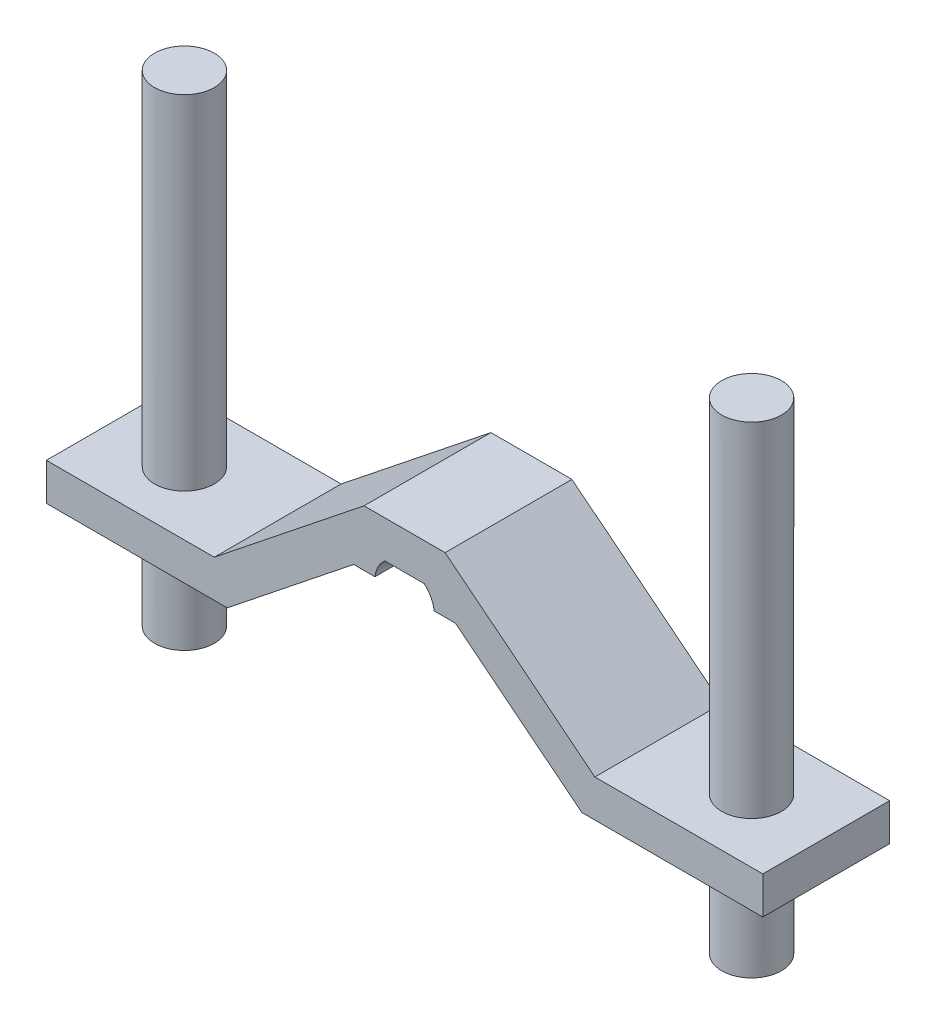
ISO-10303-21;
HEADER;
FILE_DESCRIPTION(('STEP AP214'),'2;1');
FILE_NAME('part.step','',(''),(''),'','','');
FILE_SCHEMA(('AUTOMOTIVE_DESIGN { 1 0 10303 214 1 1 1 1 }'));
ENDSEC;
DATA;
#1=APPLICATION_CONTEXT('core data for automotive mechanical design processes');
#2=APPLICATION_PROTOCOL_DEFINITION('international standard','automotive_design',2000,#1);
#3=PRODUCT_CONTEXT('',#1,'mechanical');
#4=PRODUCT('Part','Part','',(#3));
#5=PRODUCT_RELATED_PRODUCT_CATEGORY('part','',(#4));
#6=PRODUCT_DEFINITION_FORMATION('','',#4);
#7=PRODUCT_DEFINITION_CONTEXT('part definition',#1,'design');
#8=PRODUCT_DEFINITION('design','',#6,#7);
#9=PRODUCT_DEFINITION_SHAPE('','',#8);
#10=(LENGTH_UNIT() NAMED_UNIT(*) SI_UNIT(.MILLI.,.METRE.));
#11=(NAMED_UNIT(*) PLANE_ANGLE_UNIT() SI_UNIT($,.RADIAN.));
#12=(NAMED_UNIT(*) SI_UNIT($,.STERADIAN.) SOLID_ANGLE_UNIT());
#13=UNCERTAINTY_MEASURE_WITH_UNIT(LENGTH_MEASURE(1.E-05),#10,'distance_accuracy_value','');
#14=(GEOMETRIC_REPRESENTATION_CONTEXT(3) GLOBAL_UNCERTAINTY_ASSIGNED_CONTEXT((#13)) GLOBAL_UNIT_ASSIGNED_CONTEXT((#10,
#11,#12)) REPRESENTATION_CONTEXT('',''));
#15=CARTESIAN_POINT('',(0.,0.,0.));
#16=DIRECTION('',(0.,0.,1.));
#17=DIRECTION('',(1.,0.,0.));
#18=AXIS2_PLACEMENT_3D('',#15,#16,#17);
#19=CARTESIAN_POINT('',(0.,0.,-138.785495179433));
#20=DIRECTION('',(0.,0.,1.));
#21=DIRECTION('',(1.,0.,0.));
#22=AXIS2_PLACEMENT_3D('',#19,#20,#21);
#23=CYLINDRICAL_SURFACE('',#22,7.99999999997841);
#24=CARTESIAN_POINT('',(0.,0.,-33.9999999999999));
#25=DIRECTION('',(0.,0.,1.));
#26=DIRECTION('',(1.,0.,0.));
#27=AXIS2_PLACEMENT_3D('',#24,#25,#26);
#28=CIRCLE('',#27,7.99999999997841);
#29=CARTESIAN_POINT('',(-5.29150262212852,5.9999999999718,-33.9999999999999));
#30=VERTEX_POINT('',#29);
#31=CARTESIAN_POINT('',(-7.93725393317202,1.,-33.9999999999999));
#32=VERTEX_POINT('',#31);
#33=EDGE_CURVE('E48',#30,#32,#28,.T.);
#34=ORIENTED_EDGE('',*,*,#33,.F.);
#35=DIRECTION('',(0.,0.,1.));
#36=VECTOR('',#35,1.);
#37=CARTESIAN_POINT('',(-5.29150262212852,5.9999999999718,-138.785495179433));
#38=LINE('',#37,#36);
#39=CARTESIAN_POINT('',(-5.29150262212852,5.9999999999718,0.));
#40=VERTEX_POINT('',#39);
#41=EDGE_CURVE('E262',#30,#40,#38,.T.);
#42=ORIENTED_EDGE('',*,*,#41,.T.);
#43=CARTESIAN_POINT('',(0.,0.,0.));
#44=DIRECTION('',(0.,0.,-1.));
#45=DIRECTION('',(1.,0.,0.));
#46=AXIS2_PLACEMENT_3D('',#43,#44,#45);
#47=CIRCLE('',#46,7.99999999997841);
#48=CARTESIAN_POINT('',(-7.93725393317202,1.,0.));
#49=VERTEX_POINT('',#48);
#50=EDGE_CURVE('E160',#49,#40,#47,.T.);
#51=ORIENTED_EDGE('',*,*,#50,.F.);
#52=DIRECTION('',(0.,0.,1.));
#53=VECTOR('',#52,1.);
#54=CARTESIAN_POINT('',(-7.93725393317202,1.,-138.785495179433));
#55=LINE('',#54,#53);
#56=EDGE_CURVE('E230',#32,#49,#55,.T.);
#57=ORIENTED_EDGE('',*,*,#56,.F.);
#58=EDGE_LOOP('',(#34,#42,#51,#57));
#59=FACE_BOUND('',#58,.T.);
#60=ADVANCED_FACE('F40',(#59),#23,.F.);
#61=CARTESIAN_POINT('',(-13.6369618976621,1.,-138.785495179433));
#62=DIRECTION('',(0.,-1.,0.));
#63=DIRECTION('',(0.,0.,-1.));
#64=AXIS2_PLACEMENT_3D('',#61,#62,#63);
#65=PLANE('',#64);
#66=DIRECTION('',(-1.,0.,0.));
#67=VECTOR('',#66,1.);
#68=CARTESIAN_POINT('',(-13.6369618976621,1.,-33.9999999999999));
#69=LINE('',#68,#67);
#70=CARTESIAN_POINT('',(-13.6369618976621,0.999999999999997,-33.9999999999999));
#71=VERTEX_POINT('',#70);
#72=EDGE_CURVE('E239',#32,#71,#69,.T.);
#73=ORIENTED_EDGE('',*,*,#72,.F.);
#74=ORIENTED_EDGE('',*,*,#56,.T.);
#75=DIRECTION('',(1.,0.,0.));
#76=VECTOR('',#75,1.);
#77=CARTESIAN_POINT('',(-13.6369618976621,1.,0.));
#78=LINE('',#77,#76);
#79=CARTESIAN_POINT('',(-13.6369618976621,1.,0.));
#80=VERTEX_POINT('',#79);
#81=EDGE_CURVE('E260',#80,#49,#78,.T.);
#82=ORIENTED_EDGE('',*,*,#81,.F.);
#83=DIRECTION('',(0.,0.,1.));
#84=VECTOR('',#83,1.);
#85=CARTESIAN_POINT('',(-13.6369618976621,1.,-138.785495179433));
#86=LINE('',#85,#84);
#87=EDGE_CURVE('E264',#71,#80,#86,.T.);
#88=ORIENTED_EDGE('',*,*,#87,.F.);
#89=EDGE_LOOP('',(#73,#74,#82,#88));
#90=FACE_BOUND('',#89,.T.);
#91=ADVANCED_FACE('F284',(#90),#65,.T.);
#92=CARTESIAN_POINT('',(-47.5014601775497,-25.9999999999996,-138.785495179433));
#93=DIRECTION('',(0.623404606589831,-0.781899415834657,0.));
#94=DIRECTION('',(0.781899415834657,0.623404606589832,0.));
#95=AXIS2_PLACEMENT_3D('',#92,#93,#94);
#96=PLANE('',#95);
#97=DIRECTION('',(-0.781899415834657,-0.623404606589832,0.));
#98=VECTOR('',#97,1.);
#99=CARTESIAN_POINT('',(-47.5014601775497,-25.9999999999996,-33.9999999999999));
#100=LINE('',#99,#98);
#101=CARTESIAN_POINT('',(-47.5014601775497,-25.9999999999996,-33.9999999999999));
#102=VERTEX_POINT('',#101);
#103=EDGE_CURVE('E237',#71,#102,#100,.T.);
#104=ORIENTED_EDGE('',*,*,#103,.F.);
#105=ORIENTED_EDGE('',*,*,#87,.T.);
#106=DIRECTION('',(0.781899415834657,0.623404606589832,0.));
#107=VECTOR('',#106,1.);
#108=CARTESIAN_POINT('',(-47.5014601775497,-25.9999999999996,0.));
#109=LINE('',#108,#107);
#110=CARTESIAN_POINT('',(-47.5014601775497,-25.9999999999996,0.));
#111=VERTEX_POINT('',#110);
#112=EDGE_CURVE('E257',#111,#80,#109,.T.);
#113=ORIENTED_EDGE('',*,*,#112,.F.);
#114=DIRECTION('',(0.,0.,1.));
#115=VECTOR('',#114,1.);
#116=CARTESIAN_POINT('',(-47.5014601775497,-25.9999999999996,-138.785495179433));
#117=LINE('',#116,#115);
#118=EDGE_CURVE('E266',#102,#111,#117,.T.);
#119=ORIENTED_EDGE('',*,*,#118,.F.);
#120=EDGE_LOOP('',(#104,#105,#113,#119));
#121=FACE_BOUND('',#120,.T.);
#122=ADVANCED_FACE('F288',(#121),#96,.T.);
#123=CARTESIAN_POINT('',(-95.9999999999999,-25.9999999999996,-138.785495179433));
#124=DIRECTION('',(0.,-1.,0.));
#125=DIRECTION('',(0.,0.,-1.));
#126=AXIS2_PLACEMENT_3D('',#123,#124,#125);
#127=PLANE('',#126);
#128=CARTESIAN_POINT('',(-75.9999999999999,-25.9999999999996,-16.9999999999999));
#129=DIRECTION('',(0.,-1.,0.));
#130=DIRECTION('',(0.,0.,-1.));
#131=AXIS2_PLACEMENT_3D('',#128,#129,#130);
#132=CIRCLE('',#131,8.00000000000001);
#133=CARTESIAN_POINT('',(-75.9999999999999,-25.9999999999996,-25.));
#134=VERTEX_POINT('',#133);
#135=EDGE_CURVE('E225',#134,#134,#132,.F.);
#136=ORIENTED_EDGE('',*,*,#135,.T.);
#137=EDGE_LOOP('',(#136));
#138=FACE_BOUND('',#137,.T.);
#139=DIRECTION('',(-1.,0.,0.));
#140=VECTOR('',#139,1.);
#141=CARTESIAN_POINT('',(-95.9999999999999,-25.9999999999996,-33.9999999999999));
#142=LINE('',#141,#140);
#143=CARTESIAN_POINT('',(-95.9999999999999,-25.9999999999996,-33.9999999999999));
#144=VERTEX_POINT('',#143);
#145=EDGE_CURVE('E235',#102,#144,#142,.T.);
#146=ORIENTED_EDGE('',*,*,#145,.F.);
#147=ORIENTED_EDGE('',*,*,#118,.T.);
#148=DIRECTION('',(1.,0.,0.));
#149=VECTOR('',#148,1.);
#150=CARTESIAN_POINT('',(-95.9999999999999,-25.9999999999996,0.));
#151=LINE('',#150,#149);
#152=CARTESIAN_POINT('',(-95.9999999999999,-25.9999999999996,0.));
#153=VERTEX_POINT('',#152);
#154=EDGE_CURVE('E254',#153,#111,#151,.T.);
#155=ORIENTED_EDGE('',*,*,#154,.F.);
#156=DIRECTION('',(0.,0.,1.));
#157=VECTOR('',#156,1.);
#158=CARTESIAN_POINT('',(-95.9999999999999,-25.9999999999996,-138.785495179433));
#159=LINE('',#158,#157);
#160=EDGE_CURVE('E268',#144,#153,#159,.T.);
#161=ORIENTED_EDGE('',*,*,#160,.F.);
#162=EDGE_LOOP('',(#146,#147,#155,#161));
#163=FACE_BOUND('',#162,.T.);
#164=ADVANCED_FACE('F295',(#138,#163),#127,.T.);
#165=CARTESIAN_POINT('',(-95.9999999999999,-15.9999999999996,-138.785495179433));
#166=DIRECTION('',(-1.,0.,0.));
#167=DIRECTION('',(0.,0.,1.));
#168=AXIS2_PLACEMENT_3D('',#165,#166,#167);
#169=PLANE('',#168);
#170=DIRECTION('',(0.,1.,0.));
#171=VECTOR('',#170,1.);
#172=CARTESIAN_POINT('',(-95.9999999999999,-15.9999999999996,-33.9999999999999));
#173=LINE('',#172,#171);
#174=CARTESIAN_POINT('',(-95.9999999999999,-15.9999999999996,-33.9999999999999));
#175=VERTEX_POINT('',#174);
#176=EDGE_CURVE('E233',#144,#175,#173,.T.);
#177=ORIENTED_EDGE('',*,*,#176,.F.);
#178=ORIENTED_EDGE('',*,*,#160,.T.);
#179=DIRECTION('',(0.,-1.,0.));
#180=VECTOR('',#179,1.);
#181=CARTESIAN_POINT('',(-95.9999999999999,-15.9999999999996,0.));
#182=LINE('',#181,#180);
#183=CARTESIAN_POINT('',(-95.9999999999999,-15.9999999999996,0.));
#184=VERTEX_POINT('',#183);
#185=EDGE_CURVE('E251',#184,#153,#182,.T.);
#186=ORIENTED_EDGE('',*,*,#185,.F.);
#187=DIRECTION('',(0.,0.,1.));
#188=VECTOR('',#187,1.);
#189=CARTESIAN_POINT('',(-95.9999999999999,-15.9999999999996,-138.785495179433));
#190=LINE('',#189,#188);
#191=EDGE_CURVE('E270',#175,#184,#190,.T.);
#192=ORIENTED_EDGE('',*,*,#191,.F.);
#193=EDGE_LOOP('',(#177,#178,#186,#192));
#194=FACE_BOUND('',#193,.T.);
#195=ADVANCED_FACE('F299',(#194),#169,.T.);
#196=CARTESIAN_POINT('',(-50.9999999999999,-15.9999999999995,-138.785495179433));
#197=DIRECTION('',(0.,1.,0.));
#198=DIRECTION('',(-1.,0.,0.));
#199=AXIS2_PLACEMENT_3D('',#196,#197,#198);
#200=PLANE('',#199);
#201=CARTESIAN_POINT('',(-75.9999999999999,-15.9999999999996,-16.9999999999999));
#202=DIRECTION('',(0.,1.,0.));
#203=DIRECTION('',(-1.,0.,0.));
#204=AXIS2_PLACEMENT_3D('',#201,#202,#203);
#205=CIRCLE('',#204,8.00000000000001);
#206=CARTESIAN_POINT('',(-83.9999999999999,-15.9999999999996,-16.9999999999999));
#207=VERTEX_POINT('',#206);
#208=EDGE_CURVE('E43',#207,#207,#205,.F.);
#209=ORIENTED_EDGE('',*,*,#208,.T.);
#210=EDGE_LOOP('',(#209));
#211=FACE_BOUND('',#210,.T.);
#212=DIRECTION('',(1.,0.,0.));
#213=VECTOR('',#212,1.);
#214=CARTESIAN_POINT('',(-50.9999999999999,-15.9999999999995,-33.9999999999999));
#215=LINE('',#214,#213);
#216=CARTESIAN_POINT('',(-50.9999999999999,-15.9999999999996,-33.9999999999999));
#217=VERTEX_POINT('',#216);
#218=EDGE_CURVE('E60',#175,#217,#215,.T.);
#219=ORIENTED_EDGE('',*,*,#218,.F.);
#220=ORIENTED_EDGE('',*,*,#191,.T.);
#221=DIRECTION('',(-1.,0.,0.));
#222=VECTOR('',#221,1.);
#223=CARTESIAN_POINT('',(-50.9999999999999,-15.9999999999995,0.));
#224=LINE('',#223,#222);
#225=CARTESIAN_POINT('',(-50.9999999999999,-15.9999999999995,0.));
#226=VERTEX_POINT('',#225);
#227=EDGE_CURVE('E248',#226,#184,#224,.T.);
#228=ORIENTED_EDGE('',*,*,#227,.F.);
#229=DIRECTION('',(0.,0.,1.));
#230=VECTOR('',#229,1.);
#231=CARTESIAN_POINT('',(-50.9999999999999,-15.9999999999995,-138.785495179433));
#232=LINE('',#231,#230);
#233=EDGE_CURVE('E272',#217,#226,#232,.T.);
#234=ORIENTED_EDGE('',*,*,#233,.F.);
#235=EDGE_LOOP('',(#219,#220,#228,#234));
#236=FACE_BOUND('',#235,.T.);
#237=ADVANCED_FACE('F302',(#211,#236),#200,.T.);
#238=CARTESIAN_POINT('',(-10.8642983349832,15.9999999999718,-138.785495179433));
#239=DIRECTION('',(-0.623404606589832,0.781899415834656,0.));
#240=DIRECTION('',(-0.781899415834656,-0.623404606589832,0.));
#241=AXIS2_PLACEMENT_3D('',#238,#239,#240);
#242=PLANE('',#241);
#243=DIRECTION('',(0.781899415834656,0.623404606589832,0.));
#244=VECTOR('',#243,1.);
#245=CARTESIAN_POINT('',(-10.8642983349832,15.9999999999718,-33.9999999999999));
#246=LINE('',#245,#244);
#247=CARTESIAN_POINT('',(-10.8642983349832,15.9999999999718,-33.9999999999999));
#248=VERTEX_POINT('',#247);
#249=EDGE_CURVE('E55',#217,#248,#246,.T.);
#250=ORIENTED_EDGE('',*,*,#249,.F.);
#251=ORIENTED_EDGE('',*,*,#233,.T.);
#252=DIRECTION('',(-0.781899415834656,-0.623404606589832,0.));
#253=VECTOR('',#252,1.);
#254=CARTESIAN_POINT('',(-10.8642983349832,15.9999999999718,0.));
#255=LINE('',#254,#253);
#256=CARTESIAN_POINT('',(-10.8642983349832,15.9999999999718,0.));
#257=VERTEX_POINT('',#256);
#258=EDGE_CURVE('E245',#257,#226,#255,.T.);
#259=ORIENTED_EDGE('',*,*,#258,.F.);
#260=DIRECTION('',(0.,0.,1.));
#261=VECTOR('',#260,1.);
#262=CARTESIAN_POINT('',(-10.8642983349832,15.9999999999718,-138.785495179433));
#263=LINE('',#262,#261);
#264=EDGE_CURVE('E274',#248,#257,#263,.T.);
#265=ORIENTED_EDGE('',*,*,#264,.F.);
#266=EDGE_LOOP('',(#250,#251,#259,#265));
#267=FACE_BOUND('',#266,.T.);
#268=ADVANCED_FACE('F306',(#267),#242,.T.);
#269=CARTESIAN_POINT('',(0.,15.9999999999718,-138.785495179433));
#270=DIRECTION('',(0.,1.,0.));
#271=DIRECTION('',(0.,0.,1.));
#272=AXIS2_PLACEMENT_3D('',#269,#270,#271);
#273=PLANE('',#272);
#274=DIRECTION('',(1.,0.,0.));
#275=VECTOR('',#274,1.);
#276=CARTESIAN_POINT('',(0.,15.9999999999718,-33.9999999999999));
#277=LINE('',#276,#275);
#278=CARTESIAN_POINT('',(10.8642983349832,15.9999999999718,-33.9999999999999));
#279=VERTEX_POINT('',#278);
#280=EDGE_CURVE('E228',#248,#279,#277,.T.);
#281=ORIENTED_EDGE('',*,*,#280,.F.);
#282=ORIENTED_EDGE('',*,*,#264,.T.);
#283=DIRECTION('',(-1.,0.,0.));
#284=VECTOR('',#283,1.);
#285=CARTESIAN_POINT('',(0.,15.9999999999718,0.));
#286=LINE('',#285,#284);
#287=CARTESIAN_POINT('',(10.8642983349832,15.9999999999718,0.));
#288=VERTEX_POINT('',#287);
#289=EDGE_CURVE('E163',#288,#257,#286,.T.);
#290=ORIENTED_EDGE('',*,*,#289,.F.);
#291=DIRECTION('',(0.,0.,1.));
#292=VECTOR('',#291,1.);
#293=CARTESIAN_POINT('',(10.8642983349832,15.9999999999718,-138.785495179433));
#294=LINE('',#293,#292);
#295=EDGE_CURVE('E171',#279,#288,#294,.T.);
#296=ORIENTED_EDGE('',*,*,#295,.F.);
#297=EDGE_LOOP('',(#281,#282,#290,#296));
#298=FACE_BOUND('',#297,.T.);
#299=ADVANCED_FACE('F309',(#298),#273,.T.);
#300=CARTESIAN_POINT('',(-5.29150262212852,5.9999999999718,-138.785495179433));
#301=DIRECTION('',(1.52982766497781E-12,-1.,0.));
#302=DIRECTION('',(1.,1.52982766497781E-12,0.));
#303=AXIS2_PLACEMENT_3D('',#300,#301,#302);
#304=PLANE('',#303);
#305=DIRECTION('',(-1.,-1.52982766497781E-12,0.));
#306=VECTOR('',#305,1.);
#307=CARTESIAN_POINT('',(-5.29150262212852,5.9999999999718,-33.9999999999999));
#308=LINE('',#307,#306);
#309=CARTESIAN_POINT('',(5.29150262212852,5.99999999997181,-33.9999999999999));
#310=VERTEX_POINT('',#309);
#311=EDGE_CURVE('E11',#310,#30,#308,.T.);
#312=ORIENTED_EDGE('',*,*,#311,.F.);
#313=DIRECTION('',(0.,0.,1.));
#314=VECTOR('',#313,1.);
#315=CARTESIAN_POINT('',(5.29150262212852,5.99999999997181,-138.785495179433));
#316=LINE('',#315,#314);
#317=CARTESIAN_POINT('',(5.29150262212852,5.99999999997181,0.));
#318=VERTEX_POINT('',#317);
#319=EDGE_CURVE('E166',#310,#318,#316,.T.);
#320=ORIENTED_EDGE('',*,*,#319,.T.);
#321=DIRECTION('',(1.,1.52982766497781E-12,0.));
#322=VECTOR('',#321,1.);
#323=CARTESIAN_POINT('',(-5.29150262212852,5.9999999999718,0.));
#324=LINE('',#323,#322);
#325=EDGE_CURVE('E151',#40,#318,#324,.T.);
#326=ORIENTED_EDGE('',*,*,#325,.F.);
#327=ORIENTED_EDGE('',*,*,#41,.F.);
#328=EDGE_LOOP('',(#312,#320,#326,#327));
#329=FACE_BOUND('',#328,.T.);
#330=ADVANCED_FACE('F167',(#329),#304,.T.);
#331=CARTESIAN_POINT('',(0.,0.,0.));
#332=DIRECTION('',(0.,0.,1.));
#333=DIRECTION('',(1.,0.,0.));
#334=AXIS2_PLACEMENT_3D('',#331,#332,#333);
#335=PLANE('',#334);
#336=ORIENTED_EDGE('',*,*,#50,.T.);
#337=ORIENTED_EDGE('',*,*,#325,.T.);
#338=CARTESIAN_POINT('',(0.,0.,0.));
#339=DIRECTION('',(0.,0.,1.));
#340=DIRECTION('',(-1.,0.,0.));
#341=AXIS2_PLACEMENT_3D('',#338,#339,#340);
#342=CIRCLE('',#341,7.99999999997841);
#343=CARTESIAN_POINT('',(7.93725393317202,1.,0.));
#344=VERTEX_POINT('',#343);
#345=EDGE_CURVE('E156',#344,#318,#342,.T.);
#346=ORIENTED_EDGE('',*,*,#345,.F.);
#347=DIRECTION('',(-1.,0.,0.));
#348=VECTOR('',#347,1.);
#349=CARTESIAN_POINT('',(13.6369618976621,1.,0.));
#350=LINE('',#349,#348);
#351=CARTESIAN_POINT('',(13.6369618976621,1.,0.));
#352=VERTEX_POINT('',#351);
#353=EDGE_CURVE('E172',#352,#344,#350,.T.);
#354=ORIENTED_EDGE('',*,*,#353,.F.);
#355=DIRECTION('',(-0.781899415834657,0.623404606589831,0.));
#356=VECTOR('',#355,1.);
#357=CARTESIAN_POINT('',(47.5014601775497,-25.9999999999996,0.));
#358=LINE('',#357,#356);
#359=CARTESIAN_POINT('',(47.5014601775497,-25.9999999999996,0.));
#360=VERTEX_POINT('',#359);
#361=EDGE_CURVE('E194',#360,#352,#358,.T.);
#362=ORIENTED_EDGE('',*,*,#361,.F.);
#363=DIRECTION('',(-1.,0.,0.));
#364=VECTOR('',#363,1.);
#365=CARTESIAN_POINT('',(95.9999999999999,-25.9999999999996,0.));
#366=LINE('',#365,#364);
#367=CARTESIAN_POINT('',(95.9999999999999,-25.9999999999996,0.));
#368=VERTEX_POINT('',#367);
#369=EDGE_CURVE('E192',#368,#360,#366,.T.);
#370=ORIENTED_EDGE('',*,*,#369,.F.);
#371=DIRECTION('',(0.,-1.,0.));
#372=VECTOR('',#371,1.);
#373=CARTESIAN_POINT('',(95.9999999999999,-15.9999999999995,0.));
#374=LINE('',#373,#372);
#375=CARTESIAN_POINT('',(95.9999999999999,-15.9999999999995,0.));
#376=VERTEX_POINT('',#375);
#377=EDGE_CURVE('E190',#376,#368,#374,.T.);
#378=ORIENTED_EDGE('',*,*,#377,.F.);
#379=DIRECTION('',(1.,0.,0.));
#380=VECTOR('',#379,1.);
#381=CARTESIAN_POINT('',(50.9999999999999,-15.9999999999995,0.));
#382=LINE('',#381,#380);
#383=CARTESIAN_POINT('',(50.9999999999999,-15.9999999999995,0.));
#384=VERTEX_POINT('',#383);
#385=EDGE_CURVE('E180',#384,#376,#382,.T.);
#386=ORIENTED_EDGE('',*,*,#385,.F.);
#387=DIRECTION('',(0.781899415834656,-0.623404606589832,0.));
#388=VECTOR('',#387,1.);
#389=CARTESIAN_POINT('',(10.8642983349832,15.9999999999718,0.));
#390=LINE('',#389,#388);
#391=EDGE_CURVE('E177',#288,#384,#390,.T.);
#392=ORIENTED_EDGE('',*,*,#391,.F.);
#393=ORIENTED_EDGE('',*,*,#289,.T.);
#394=ORIENTED_EDGE('',*,*,#258,.T.);
#395=ORIENTED_EDGE('',*,*,#227,.T.);
#396=ORIENTED_EDGE('',*,*,#185,.T.);
#397=ORIENTED_EDGE('',*,*,#154,.T.);
#398=ORIENTED_EDGE('',*,*,#112,.T.);
#399=ORIENTED_EDGE('',*,*,#81,.T.);
#400=EDGE_LOOP('',(#336,#337,#346,#354,#362,#370,#378,#386,#392,#393,#394,#395,#396,#397,#398,#399));
#401=FACE_BOUND('',#400,.T.);
#402=ADVANCED_FACE('F153',(#401),#335,.T.);
#403=CARTESIAN_POINT('',(7.99999999999956,0.,-33.9999999999999));
#404=DIRECTION('',(0.,0.,1.));
#405=DIRECTION('',(0.,-1.,0.));
#406=AXIS2_PLACEMENT_3D('',#403,#404,#405);
#407=PLANE('',#406);
#408=ORIENTED_EDGE('',*,*,#33,.T.);
#409=ORIENTED_EDGE('',*,*,#72,.T.);
#410=ORIENTED_EDGE('',*,*,#103,.T.);
#411=ORIENTED_EDGE('',*,*,#145,.T.);
#412=ORIENTED_EDGE('',*,*,#176,.T.);
#413=ORIENTED_EDGE('',*,*,#218,.T.);
#414=ORIENTED_EDGE('',*,*,#249,.T.);
#415=ORIENTED_EDGE('',*,*,#280,.T.);
#416=DIRECTION('',(-0.781899415834656,0.623404606589832,0.));
#417=VECTOR('',#416,1.);
#418=CARTESIAN_POINT('',(10.8642983349832,15.9999999999718,-33.9999999999999));
#419=LINE('',#418,#417);
#420=CARTESIAN_POINT('',(50.9999999999999,-15.9999999999995,-33.9999999999999));
#421=VERTEX_POINT('',#420);
#422=EDGE_CURVE('E198',#421,#279,#419,.T.);
#423=ORIENTED_EDGE('',*,*,#422,.F.);
#424=DIRECTION('',(-1.,0.,0.));
#425=VECTOR('',#424,1.);
#426=CARTESIAN_POINT('',(50.9999999999999,-15.9999999999995,-33.9999999999999));
#427=LINE('',#426,#425);
#428=CARTESIAN_POINT('',(95.9999999999999,-15.9999999999995,-33.9999999999999));
#429=VERTEX_POINT('',#428);
#430=EDGE_CURVE('E315',#429,#421,#427,.T.);
#431=ORIENTED_EDGE('',*,*,#430,.F.);
#432=DIRECTION('',(0.,1.,0.));
#433=VECTOR('',#432,1.);
#434=CARTESIAN_POINT('',(95.9999999999999,-15.9999999999995,-33.9999999999999));
#435=LINE('',#434,#433);
#436=CARTESIAN_POINT('',(95.9999999999999,-25.9999999999996,-33.9999999999999));
#437=VERTEX_POINT('',#436);
#438=EDGE_CURVE('E324',#437,#429,#435,.T.);
#439=ORIENTED_EDGE('',*,*,#438,.F.);
#440=DIRECTION('',(1.,0.,0.));
#441=VECTOR('',#440,1.);
#442=CARTESIAN_POINT('',(95.9999999999999,-25.9999999999996,-33.9999999999999));
#443=LINE('',#442,#441);
#444=CARTESIAN_POINT('',(47.5014601775497,-25.9999999999996,-33.9999999999999));
#445=VERTEX_POINT('',#444);
#446=EDGE_CURVE('E326',#445,#437,#443,.T.);
#447=ORIENTED_EDGE('',*,*,#446,.F.);
#448=DIRECTION('',(0.781899415834657,-0.623404606589831,0.));
#449=VECTOR('',#448,1.);
#450=CARTESIAN_POINT('',(47.5014601775497,-25.9999999999996,-33.9999999999999));
#451=LINE('',#450,#449);
#452=CARTESIAN_POINT('',(13.6369618976621,0.999999999999999,-33.9999999999999));
#453=VERTEX_POINT('',#452);
#454=EDGE_CURVE('E331',#453,#445,#451,.T.);
#455=ORIENTED_EDGE('',*,*,#454,.F.);
#456=DIRECTION('',(1.,0.,0.));
#457=VECTOR('',#456,1.);
#458=CARTESIAN_POINT('',(13.6369618976621,1.,-33.9999999999999));
#459=LINE('',#458,#457);
#460=CARTESIAN_POINT('',(7.93725393317202,1.,-33.9999999999999));
#461=VERTEX_POINT('',#460);
#462=EDGE_CURVE('E333',#461,#453,#459,.T.);
#463=ORIENTED_EDGE('',*,*,#462,.F.);
#464=CARTESIAN_POINT('',(0.,0.,-33.9999999999999));
#465=DIRECTION('',(0.,0.,-1.));
#466=DIRECTION('',(-1.,0.,0.));
#467=AXIS2_PLACEMENT_3D('',#464,#465,#466);
#468=CIRCLE('',#467,7.99999999997841);
#469=EDGE_CURVE('E186',#310,#461,#468,.T.);
#470=ORIENTED_EDGE('',*,*,#469,.F.);
#471=ORIENTED_EDGE('',*,*,#311,.T.);
#472=EDGE_LOOP('',(#408,#409,#410,#411,#412,#413,#414,#415,#423,#431,#439,#447,#455,#463,#470,#471));
#473=FACE_BOUND('',#472,.T.);
#474=ADVANCED_FACE('F280',(#473),#407,.F.);
#475=CARTESIAN_POINT('',(-75.9999999999999,76.0000000000004,-16.9999999999999));
#476=DIRECTION('',(0.,-1.,0.));
#477=DIRECTION('',(1.,0.,0.));
#478=AXIS2_PLACEMENT_3D('',#475,#476,#477);
#479=PLANE('',#478);
#480=CARTESIAN_POINT('',(-75.9999999999999,76.0000000000004,-16.9999999999999));
#481=DIRECTION('',(0.,-1.,0.));
#482=DIRECTION('',(0.,0.,-1.));
#483=AXIS2_PLACEMENT_3D('',#480,#481,#482);
#484=CIRCLE('',#483,8.00000000000001);
#485=CARTESIAN_POINT('',(-75.9999999999999,76.0000000000004,-25.));
#486=VERTEX_POINT('',#485);
#487=EDGE_CURVE('E222',#486,#486,#484,.T.);
#488=ORIENTED_EDGE('',*,*,#487,.F.);
#489=EDGE_LOOP('',(#488));
#490=FACE_BOUND('',#489,.T.);
#491=ADVANCED_FACE('F389',(#490),#479,.F.);
#492=CARTESIAN_POINT('',(-75.9999999999999,118.62741699797,-16.9999999999999));
#493=DIRECTION('',(0.,-1.,0.));
#494=DIRECTION('',(1.,0.,0.));
#495=AXIS2_PLACEMENT_3D('',#492,#493,#494);
#496=CYLINDRICAL_SURFACE('',#495,8.00000000000001);
#497=ORIENTED_EDGE('',*,*,#208,.F.);
#498=EDGE_LOOP('',(#497));
#499=FACE_BOUND('',#498,.T.);
#500=ORIENTED_EDGE('',*,*,#487,.T.);
#501=EDGE_LOOP('',(#500));
#502=FACE_BOUND('',#501,.T.);
#503=ADVANCED_FACE('F393',(#499,#502),#496,.T.);
#504=ORIENTED_EDGE('',*,*,#135,.F.);
#505=EDGE_LOOP('',(#504));
#506=FACE_BOUND('',#505,.T.);
#507=CARTESIAN_POINT('',(-75.9999999999999,-52.9999999999996,-16.9999999999999));
#508=DIRECTION('',(0.,-1.,0.));
#509=DIRECTION('',(1.,0.,0.));
#510=AXIS2_PLACEMENT_3D('',#507,#508,#509);
#511=CIRCLE('',#510,8.00000000000001);
#512=CARTESIAN_POINT('',(-67.9999999999999,-52.9999999999996,-16.9999999999999));
#513=VERTEX_POINT('',#512);
#514=EDGE_CURVE('E219',#513,#513,#511,.F.);
#515=ORIENTED_EDGE('',*,*,#514,.T.);
#516=EDGE_LOOP('',(#515));
#517=FACE_BOUND('',#516,.T.);
#518=ADVANCED_FACE('F398',(#506,#517),#496,.T.);
#519=CARTESIAN_POINT('',(0.,-52.9999999999995,-138.785495179433));
#520=DIRECTION('',(0.,-1.,0.));
#521=DIRECTION('',(1.,0.,0.));
#522=AXIS2_PLACEMENT_3D('',#519,#520,#521);
#523=PLANE('',#522);
#524=ORIENTED_EDGE('',*,*,#514,.F.);
#525=EDGE_LOOP('',(#524));
#526=FACE_BOUND('',#525,.T.);
#527=ADVANCED_FACE('F401',(#526),#523,.T.);
#528=CARTESIAN_POINT('',(0.,0.,-138.785495179433));
#529=DIRECTION('',(0.,0.,1.));
#530=DIRECTION('',(-1.,0.,0.));
#531=AXIS2_PLACEMENT_3D('',#528,#529,#530);
#532=CYLINDRICAL_SURFACE('',#531,7.99999999997841);
#533=ORIENTED_EDGE('',*,*,#469,.T.);
#534=DIRECTION('',(0.,0.,1.));
#535=VECTOR('',#534,1.);
#536=CARTESIAN_POINT('',(7.93725393317202,1.,-138.785495179433));
#537=LINE('',#536,#535);
#538=EDGE_CURVE('E176',#461,#344,#537,.T.);
#539=ORIENTED_EDGE('',*,*,#538,.T.);
#540=ORIENTED_EDGE('',*,*,#345,.T.);
#541=ORIENTED_EDGE('',*,*,#319,.F.);
#542=EDGE_LOOP('',(#533,#539,#540,#541));
#543=FACE_BOUND('',#542,.T.);
#544=ADVANCED_FACE('F174',(#543),#532,.F.);
#545=CARTESIAN_POINT('',(13.6369618976621,1.,-138.785495179433));
#546=DIRECTION('',(0.,-1.,0.));
#547=DIRECTION('',(0.,0.,-1.));
#548=AXIS2_PLACEMENT_3D('',#545,#546,#547);
#549=PLANE('',#548);
#550=ORIENTED_EDGE('',*,*,#462,.T.);
#551=DIRECTION('',(0.,0.,1.));
#552=VECTOR('',#551,1.);
#553=CARTESIAN_POINT('',(13.6369618976621,1.,-138.785495179433));
#554=LINE('',#553,#552);
#555=EDGE_CURVE('E199',#453,#352,#554,.T.);
#556=ORIENTED_EDGE('',*,*,#555,.T.);
#557=ORIENTED_EDGE('',*,*,#353,.T.);
#558=ORIENTED_EDGE('',*,*,#538,.F.);
#559=EDGE_LOOP('',(#550,#556,#557,#558));
#560=FACE_BOUND('',#559,.T.);
#561=ADVANCED_FACE('F337',(#560),#549,.T.);
#562=CARTESIAN_POINT('',(47.5014601775497,-25.9999999999996,-138.785495179433));
#563=DIRECTION('',(-0.623404606589831,-0.781899415834657,0.));
#564=DIRECTION('',(-0.781899415834657,0.623404606589831,0.));
#565=AXIS2_PLACEMENT_3D('',#562,#563,#564);
#566=PLANE('',#565);
#567=ORIENTED_EDGE('',*,*,#454,.T.);
#568=DIRECTION('',(0.,0.,1.));
#569=VECTOR('',#568,1.);
#570=CARTESIAN_POINT('',(47.5014601775497,-25.9999999999996,-138.785495179433));
#571=LINE('',#570,#569);
#572=EDGE_CURVE('E202',#445,#360,#571,.T.);
#573=ORIENTED_EDGE('',*,*,#572,.T.);
#574=ORIENTED_EDGE('',*,*,#361,.T.);
#575=ORIENTED_EDGE('',*,*,#555,.F.);
#576=EDGE_LOOP('',(#567,#573,#574,#575));
#577=FACE_BOUND('',#576,.T.);
#578=ADVANCED_FACE('F343',(#577),#566,.T.);
#579=CARTESIAN_POINT('',(95.9999999999999,-25.9999999999996,-138.785495179433));
#580=DIRECTION('',(0.,-1.,0.));
#581=DIRECTION('',(0.,0.,-1.));
#582=AXIS2_PLACEMENT_3D('',#579,#580,#581);
#583=PLANE('',#582);
#584=CARTESIAN_POINT('',(75.9999999999999,-25.9999999999996,-16.9999999999999));
#585=DIRECTION('',(0.,1.,0.));
#586=DIRECTION('',(0.,0.,-1.));
#587=AXIS2_PLACEMENT_3D('',#584,#585,#586);
#588=CIRCLE('',#587,8.00000000000001);
#589=CARTESIAN_POINT('',(75.9999999999999,-25.9999999999996,-25.));
#590=VERTEX_POINT('',#589);
#591=EDGE_CURVE('E178',#590,#590,#588,.F.);
#592=ORIENTED_EDGE('',*,*,#591,.F.);
#593=EDGE_LOOP('',(#592));
#594=FACE_BOUND('',#593,.T.);
#595=ORIENTED_EDGE('',*,*,#446,.T.);
#596=DIRECTION('',(0.,0.,1.));
#597=VECTOR('',#596,1.);
#598=CARTESIAN_POINT('',(95.9999999999999,-25.9999999999996,-138.785495179433));
#599=LINE('',#598,#597);
#600=EDGE_CURVE('E205',#437,#368,#599,.T.);
#601=ORIENTED_EDGE('',*,*,#600,.T.);
#602=ORIENTED_EDGE('',*,*,#369,.T.);
#603=ORIENTED_EDGE('',*,*,#572,.F.);
#604=EDGE_LOOP('',(#595,#601,#602,#603));
#605=FACE_BOUND('',#604,.T.);
#606=ADVANCED_FACE('F345',(#594,#605),#583,.T.);
#607=CARTESIAN_POINT('',(95.9999999999999,-15.9999999999995,-138.785495179433));
#608=DIRECTION('',(1.,0.,0.));
#609=DIRECTION('',(0.,0.,1.));
#610=AXIS2_PLACEMENT_3D('',#607,#608,#609);
#611=PLANE('',#610);
#612=ORIENTED_EDGE('',*,*,#438,.T.);
#613=DIRECTION('',(0.,0.,1.));
#614=VECTOR('',#613,1.);
#615=CARTESIAN_POINT('',(95.9999999999999,-15.9999999999995,-138.785495179433));
#616=LINE('',#615,#614);
#617=EDGE_CURVE('E208',#429,#376,#616,.T.);
#618=ORIENTED_EDGE('',*,*,#617,.T.);
#619=ORIENTED_EDGE('',*,*,#377,.T.);
#620=ORIENTED_EDGE('',*,*,#600,.F.);
#621=EDGE_LOOP('',(#612,#618,#619,#620));
#622=FACE_BOUND('',#621,.T.);
#623=ADVANCED_FACE('F348',(#622),#611,.T.);
#624=CARTESIAN_POINT('',(50.9999999999999,-15.9999999999995,-138.785495179433));
#625=DIRECTION('',(0.,1.,0.));
#626=DIRECTION('',(1.,0.,0.));
#627=AXIS2_PLACEMENT_3D('',#624,#625,#626);
#628=PLANE('',#627);
#629=CARTESIAN_POINT('',(75.9999999999999,-15.9999999999995,-16.9999999999999));
#630=DIRECTION('',(0.,-1.,0.));
#631=DIRECTION('',(1.,0.,0.));
#632=AXIS2_PLACEMENT_3D('',#629,#630,#631);
#633=CIRCLE('',#632,8.00000000000001);
#634=CARTESIAN_POINT('',(83.9999999999999,-15.9999999999995,-16.9999999999999));
#635=VERTEX_POINT('',#634);
#636=EDGE_CURVE('E183',#635,#635,#633,.F.);
#637=ORIENTED_EDGE('',*,*,#636,.F.);
#638=EDGE_LOOP('',(#637));
#639=FACE_BOUND('',#638,.T.);
#640=ORIENTED_EDGE('',*,*,#430,.T.);
#641=DIRECTION('',(0.,0.,1.));
#642=VECTOR('',#641,1.);
#643=CARTESIAN_POINT('',(50.9999999999999,-15.9999999999995,-138.785495179433));
#644=LINE('',#643,#642);
#645=EDGE_CURVE('E211',#421,#384,#644,.T.);
#646=ORIENTED_EDGE('',*,*,#645,.T.);
#647=ORIENTED_EDGE('',*,*,#385,.T.);
#648=ORIENTED_EDGE('',*,*,#617,.F.);
#649=EDGE_LOOP('',(#640,#646,#647,#648));
#650=FACE_BOUND('',#649,.T.);
#651=ADVANCED_FACE('F322',(#639,#650),#628,.T.);
#652=CARTESIAN_POINT('',(10.8642983349832,15.9999999999718,-138.785495179433));
#653=DIRECTION('',(0.623404606589832,0.781899415834656,0.));
#654=DIRECTION('',(0.781899415834656,-0.623404606589832,0.));
#655=AXIS2_PLACEMENT_3D('',#652,#653,#654);
#656=PLANE('',#655);
#657=ORIENTED_EDGE('',*,*,#422,.T.);
#658=ORIENTED_EDGE('',*,*,#295,.T.);
#659=ORIENTED_EDGE('',*,*,#391,.T.);
#660=ORIENTED_EDGE('',*,*,#645,.F.);
#661=EDGE_LOOP('',(#657,#658,#659,#660));
#662=FACE_BOUND('',#661,.T.);
#663=ADVANCED_FACE('F319',(#662),#656,.T.);
#664=CARTESIAN_POINT('',(75.9999999999999,76.0000000000004,-16.9999999999999));
#665=DIRECTION('',(0.,-1.,0.));
#666=DIRECTION('',(-1.,0.,0.));
#667=AXIS2_PLACEMENT_3D('',#664,#665,#666);
#668=PLANE('',#667);
#669=CARTESIAN_POINT('',(75.9999999999999,76.0000000000004,-16.9999999999999));
#670=DIRECTION('',(0.,1.,0.));
#671=DIRECTION('',(0.,0.,-1.));
#672=AXIS2_PLACEMENT_3D('',#669,#670,#671);
#673=CIRCLE('',#672,8.00000000000001);
#674=CARTESIAN_POINT('',(75.9999999999999,76.0000000000004,-25.));
#675=VERTEX_POINT('',#674);
#676=EDGE_CURVE('E218',#675,#675,#673,.T.);
#677=ORIENTED_EDGE('',*,*,#676,.T.);
#678=EDGE_LOOP('',(#677));
#679=FACE_BOUND('',#678,.T.);
#680=ADVANCED_FACE('F408',(#679),#668,.F.);
#681=CARTESIAN_POINT('',(75.9999999999999,118.62741699797,-16.9999999999999));
#682=DIRECTION('',(0.,-1.,0.));
#683=DIRECTION('',(-1.,0.,0.));
#684=AXIS2_PLACEMENT_3D('',#681,#682,#683);
#685=CYLINDRICAL_SURFACE('',#684,8.00000000000001);
#686=ORIENTED_EDGE('',*,*,#636,.T.);
#687=EDGE_LOOP('',(#686));
#688=FACE_BOUND('',#687,.T.);
#689=ORIENTED_EDGE('',*,*,#676,.F.);
#690=EDGE_LOOP('',(#689));
#691=FACE_BOUND('',#690,.T.);
#692=ADVANCED_FACE('F412',(#688,#691),#685,.T.);
#693=ORIENTED_EDGE('',*,*,#591,.T.);
#694=EDGE_LOOP('',(#693));
#695=FACE_BOUND('',#694,.T.);
#696=CARTESIAN_POINT('',(75.9999999999999,-52.9999999999996,-16.9999999999999));
#697=DIRECTION('',(0.,1.,0.));
#698=DIRECTION('',(-1.,0.,0.));
#699=AXIS2_PLACEMENT_3D('',#696,#697,#698);
#700=CIRCLE('',#699,8.00000000000001);
#701=CARTESIAN_POINT('',(67.9999999999999,-52.9999999999996,-16.9999999999999));
#702=VERTEX_POINT('',#701);
#703=EDGE_CURVE('E482',#702,#702,#700,.F.);
#704=ORIENTED_EDGE('',*,*,#703,.F.);
#705=EDGE_LOOP('',(#704));
#706=FACE_BOUND('',#705,.T.);
#707=ADVANCED_FACE('F418',(#695,#706),#685,.T.);
#708=CARTESIAN_POINT('',(0.,-52.9999999999995,-138.785495179433));
#709=DIRECTION('',(0.,-1.,0.));
#710=DIRECTION('',(-1.,0.,0.));
#711=AXIS2_PLACEMENT_3D('',#708,#709,#710);
#712=PLANE('',#711);
#713=ORIENTED_EDGE('',*,*,#703,.T.);
#714=EDGE_LOOP('',(#713));
#715=FACE_BOUND('',#714,.T.);
#716=ADVANCED_FACE('F423',(#715),#712,.T.);
#717=CLOSED_SHELL('',(#60,#91,#122,#164,#195,#237,#268,#299,#330,#402,#474,#491,#503,#518,#527,
#544,#561,#578,#606,#623,#651,#663,#680,#692,#707,#716));
#718=MANIFOLD_SOLID_BREP('B2',#717);
#719=ADVANCED_BREP_SHAPE_REPRESENTATION('',(#18,#718),#14);
#720=SHAPE_DEFINITION_REPRESENTATION(#9,#719);
ENDSEC;
END-ISO-10303-21;
